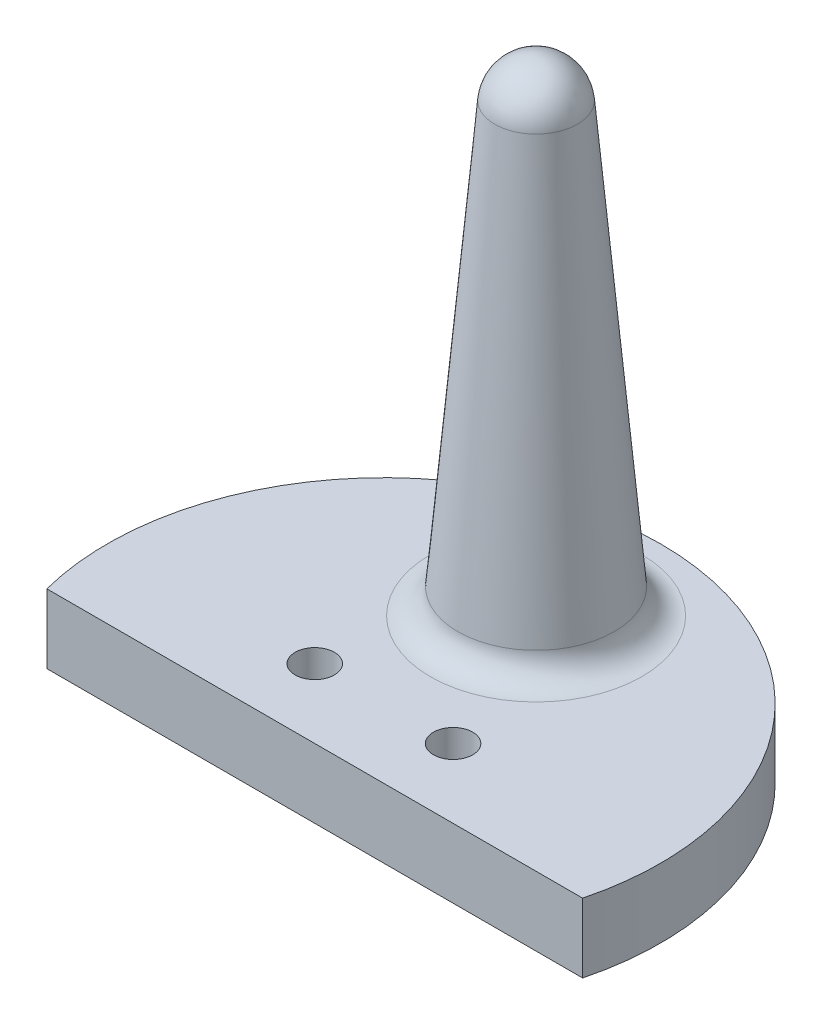
ISO-10303-21;
HEADER;
FILE_DESCRIPTION(('STEP AP214'),'2;1');
FILE_NAME('part.step','',(''),(''),'','','');
FILE_SCHEMA(('AUTOMOTIVE_DESIGN { 1 0 10303 214 1 1 1 1 }'));
ENDSEC;
DATA;
#1=APPLICATION_CONTEXT('core data for automotive mechanical design processes');
#2=APPLICATION_PROTOCOL_DEFINITION('international standard','automotive_design',2000,#1);
#3=PRODUCT_CONTEXT('',#1,'mechanical');
#4=PRODUCT('Part','Part','',(#3));
#5=PRODUCT_RELATED_PRODUCT_CATEGORY('part','',(#4));
#6=PRODUCT_DEFINITION_FORMATION('','',#4);
#7=PRODUCT_DEFINITION_CONTEXT('part definition',#1,'design');
#8=PRODUCT_DEFINITION('design','',#6,#7);
#9=PRODUCT_DEFINITION_SHAPE('','',#8);
#10=(LENGTH_UNIT() NAMED_UNIT(*) SI_UNIT(.MILLI.,.METRE.));
#11=(NAMED_UNIT(*) PLANE_ANGLE_UNIT() SI_UNIT($,.RADIAN.));
#12=(NAMED_UNIT(*) SI_UNIT($,.STERADIAN.) SOLID_ANGLE_UNIT());
#13=UNCERTAINTY_MEASURE_WITH_UNIT(LENGTH_MEASURE(1.E-05),#10,'distance_accuracy_value','');
#14=(GEOMETRIC_REPRESENTATION_CONTEXT(3) GLOBAL_UNCERTAINTY_ASSIGNED_CONTEXT((#13)) GLOBAL_UNIT_ASSIGNED_CONTEXT((#10,
#11,#12)) REPRESENTATION_CONTEXT('',''));
#15=CARTESIAN_POINT('',(0.,0.,0.));
#16=DIRECTION('',(0.,0.,1.));
#17=DIRECTION('',(1.,0.,0.));
#18=AXIS2_PLACEMENT_3D('',#15,#16,#17);
#19=CARTESIAN_POINT('',(0.,5.,0.));
#20=DIRECTION('',(0.,1.,0.));
#21=DIRECTION('',(0.,0.,1.));
#22=AXIS2_PLACEMENT_3D('',#19,#20,#21);
#23=PLANE('',#22);
#24=CARTESIAN_POINT('',(0.,5.,-11.));
#25=DIRECTION('',(0.,1.,0.));
#26=DIRECTION('',(0.,0.,1.));
#27=AXIS2_PLACEMENT_3D('',#24,#25,#26);
#28=CIRCLE('',#27,7.64375909349457);
#29=CARTESIAN_POINT('',(0.,5.,-3.35624090650543));
#30=VERTEX_POINT('',#29);
#31=EDGE_CURVE('E42',#30,#30,#28,.F.);
#32=ORIENTED_EDGE('',*,*,#31,.T.);
#33=EDGE_LOOP('',(#32));
#34=FACE_BOUND('',#33,.T.);
#35=CARTESIAN_POINT('',(-5.,5.,0.));
#36=DIRECTION('',(0.,1.,0.));
#37=DIRECTION('',(0.,0.,1.));
#38=AXIS2_PLACEMENT_3D('',#35,#36,#37);
#39=CIRCLE('',#38,1.42);
#40=CARTESIAN_POINT('',(-5.,5.,1.42));
#41=VERTEX_POINT('',#40);
#42=EDGE_CURVE('E75',#41,#41,#39,.T.);
#43=ORIENTED_EDGE('',*,*,#42,.F.);
#44=EDGE_LOOP('',(#43));
#45=FACE_BOUND('',#44,.T.);
#46=CARTESIAN_POINT('',(0.,5.,0.));
#47=DIRECTION('',(0.,1.,0.));
#48=DIRECTION('',(0.,0.,1.));
#49=AXIS2_PLACEMENT_3D('',#46,#47,#48);
#50=CIRCLE('',#49,20.);
#51=CARTESIAN_POINT('',(19.3649167310371,5.,5.));
#52=VERTEX_POINT('',#51);
#53=CARTESIAN_POINT('',(-19.3649167310371,5.,5.));
#54=VERTEX_POINT('',#53);
#55=EDGE_CURVE('E67',#52,#54,#50,.T.);
#56=ORIENTED_EDGE('',*,*,#55,.T.);
#57=DIRECTION('',(1.,0.,0.));
#58=VECTOR('',#57,1.);
#59=CARTESIAN_POINT('',(-19.3649167310371,5.,5.));
#60=LINE('',#59,#58);
#61=EDGE_CURVE('E49',#54,#52,#60,.T.);
#62=ORIENTED_EDGE('',*,*,#61,.T.);
#63=EDGE_LOOP('',(#56,#62));
#64=FACE_BOUND('',#63,.T.);
#65=CARTESIAN_POINT('',(5.,5.,0.));
#66=DIRECTION('',(0.,1.,0.));
#67=DIRECTION('',(0.,0.,1.));
#68=AXIS2_PLACEMENT_3D('',#65,#66,#67);
#69=CIRCLE('',#68,1.42);
#70=CARTESIAN_POINT('',(5.,5.,1.42));
#71=VERTEX_POINT('',#70);
#72=EDGE_CURVE('E175',#71,#71,#69,.T.);
#73=ORIENTED_EDGE('',*,*,#72,.F.);
#74=EDGE_LOOP('',(#73));
#75=FACE_BOUND('',#74,.T.);
#76=ADVANCED_FACE('F33',(#34,#45,#64,#75),#23,.T.);
#77=CARTESIAN_POINT('',(0.,0.,0.));
#78=DIRECTION('',(0.,1.,0.));
#79=DIRECTION('',(0.,0.,1.));
#80=AXIS2_PLACEMENT_3D('',#77,#78,#79);
#81=PLANE('',#80);
#82=CARTESIAN_POINT('',(0.,0.,0.));
#83=DIRECTION('',(0.,1.,0.));
#84=DIRECTION('',(0.,0.,1.));
#85=AXIS2_PLACEMENT_3D('',#82,#83,#84);
#86=CIRCLE('',#85,20.);
#87=CARTESIAN_POINT('',(19.3649167310371,0.,5.));
#88=VERTEX_POINT('',#87);
#89=CARTESIAN_POINT('',(-19.3649167310371,0.,5.));
#90=VERTEX_POINT('',#89);
#91=EDGE_CURVE('E68',#88,#90,#86,.T.);
#92=ORIENTED_EDGE('',*,*,#91,.F.);
#93=DIRECTION('',(1.,0.,0.));
#94=VECTOR('',#93,1.);
#95=CARTESIAN_POINT('',(-19.3649167310371,0.,5.));
#96=LINE('',#95,#94);
#97=EDGE_CURVE('E57',#90,#88,#96,.T.);
#98=ORIENTED_EDGE('',*,*,#97,.F.);
#99=EDGE_LOOP('',(#92,#98));
#100=FACE_BOUND('',#99,.T.);
#101=CARTESIAN_POINT('',(-5.,0.,0.));
#102=DIRECTION('',(0.,1.,0.));
#103=DIRECTION('',(0.,0.,1.));
#104=AXIS2_PLACEMENT_3D('',#101,#102,#103);
#105=CIRCLE('',#104,1.42);
#106=CARTESIAN_POINT('',(-5.,0.,1.42));
#107=VERTEX_POINT('',#106);
#108=EDGE_CURVE('E78',#107,#107,#105,.T.);
#109=ORIENTED_EDGE('',*,*,#108,.T.);
#110=EDGE_LOOP('',(#109));
#111=FACE_BOUND('',#110,.T.);
#112=CARTESIAN_POINT('',(5.,0.,0.));
#113=DIRECTION('',(0.,1.,0.));
#114=DIRECTION('',(0.,0.,1.));
#115=AXIS2_PLACEMENT_3D('',#112,#113,#114);
#116=CIRCLE('',#115,1.42);
#117=CARTESIAN_POINT('',(5.,0.,1.42));
#118=VERTEX_POINT('',#117);
#119=EDGE_CURVE('E172',#118,#118,#116,.T.);
#120=ORIENTED_EDGE('',*,*,#119,.T.);
#121=EDGE_LOOP('',(#120));
#122=FACE_BOUND('',#121,.T.);
#123=ADVANCED_FACE('F73',(#100,#111,#122),#81,.F.);
#124=CARTESIAN_POINT('',(0.,5.,0.));
#125=DIRECTION('',(0.,-1.,0.));
#126=DIRECTION('',(0.,0.,-1.));
#127=AXIS2_PLACEMENT_3D('',#124,#125,#126);
#128=CYLINDRICAL_SURFACE('',#127,20.);
#129=ORIENTED_EDGE('',*,*,#91,.T.);
#130=DIRECTION('',(0.,-1.,0.));
#131=VECTOR('',#130,1.);
#132=CARTESIAN_POINT('',(-19.3649167310371,5.,5.));
#133=LINE('',#132,#131);
#134=EDGE_CURVE('E65',#54,#90,#133,.T.);
#135=ORIENTED_EDGE('',*,*,#134,.F.);
#136=ORIENTED_EDGE('',*,*,#55,.F.);
#137=DIRECTION('',(0.,-1.,0.));
#138=VECTOR('',#137,1.);
#139=CARTESIAN_POINT('',(19.3649167310371,5.,5.));
#140=LINE('',#139,#138);
#141=EDGE_CURVE('E62',#52,#88,#140,.T.);
#142=ORIENTED_EDGE('',*,*,#141,.T.);
#143=EDGE_LOOP('',(#129,#135,#136,#142));
#144=FACE_BOUND('',#143,.T.);
#145=ADVANCED_FACE('F71',(#144),#128,.T.);
#146=CARTESIAN_POINT('',(-19.3649167310371,5.,5.));
#147=DIRECTION('',(0.,0.,-1.));
#148=DIRECTION('',(-1.,0.,0.));
#149=AXIS2_PLACEMENT_3D('',#146,#147,#148);
#150=PLANE('',#149);
#151=ORIENTED_EDGE('',*,*,#97,.T.);
#152=ORIENTED_EDGE('',*,*,#141,.F.);
#153=ORIENTED_EDGE('',*,*,#61,.F.);
#154=ORIENTED_EDGE('',*,*,#134,.T.);
#155=EDGE_LOOP('',(#151,#152,#153,#154));
#156=FACE_BOUND('',#155,.T.);
#157=ADVANCED_FACE('F61',(#156),#150,.F.);
#158=CARTESIAN_POINT('',(-5.,5.,0.));
#159=DIRECTION('',(0.,-1.,0.));
#160=DIRECTION('',(0.,0.,-1.));
#161=AXIS2_PLACEMENT_3D('',#158,#159,#160);
#162=CYLINDRICAL_SURFACE('',#161,1.42);
#163=ORIENTED_EDGE('',*,*,#42,.T.);
#164=EDGE_LOOP('',(#163));
#165=FACE_BOUND('',#164,.T.);
#166=ORIENTED_EDGE('',*,*,#108,.F.);
#167=EDGE_LOOP('',(#166));
#168=FACE_BOUND('',#167,.T.);
#169=ADVANCED_FACE('F105',(#165,#168),#162,.F.);
#170=CARTESIAN_POINT('',(5.,5.,0.));
#171=DIRECTION('',(0.,-1.,0.));
#172=DIRECTION('',(0.,0.,-1.));
#173=AXIS2_PLACEMENT_3D('',#170,#171,#172);
#174=CYLINDRICAL_SURFACE('',#173,1.42);
#175=ORIENTED_EDGE('',*,*,#72,.T.);
#176=EDGE_LOOP('',(#175));
#177=FACE_BOUND('',#176,.T.);
#178=ORIENTED_EDGE('',*,*,#119,.F.);
#179=EDGE_LOOP('',(#178));
#180=FACE_BOUND('',#179,.T.);
#181=ADVANCED_FACE('F124',(#177,#180),#174,.F.);
#182=CARTESIAN_POINT('',(0.,37.,-11.));
#183=DIRECTION('',(0.,-1.,0.));
#184=DIRECTION('',(-1.,0.,0.));
#185=AXIS2_PLACEMENT_3D('',#182,#183,#184);
#186=SPHERICAL_SURFACE('',#185,3.);
#187=CARTESIAN_POINT('',(0.,37.261467228243,-11.));
#188=DIRECTION('',(0.,-1.,0.));
#189=DIRECTION('',(0.,0.,-1.));
#190=AXIS2_PLACEMENT_3D('',#187,#188,#189);
#191=CIRCLE('',#190,2.98858409427524);
#192=CARTESIAN_POINT('',(0.,37.261467228243,-13.9885840942752));
#193=VERTEX_POINT('',#192);
#194=EDGE_CURVE('E170',#193,#193,#191,.T.);
#195=ORIENTED_EDGE('',*,*,#194,.F.);
#196=EDGE_LOOP('',(#195));
#197=FACE_BOUND('',#196,.T.);
#198=ADVANCED_FACE('F94',(#197),#186,.T.);
#199=CARTESIAN_POINT('',(0.,37.261467228243,-11.));
#200=DIRECTION('',(0.,-1.,0.));
#201=DIRECTION('',(0.,0.,-1.));
#202=AXIS2_PLACEMENT_3D('',#199,#200,#201);
#203=CONICAL_SURFACE('',#202,2.98858409427524,0.0872664625997202);
#204=CARTESIAN_POINT('',(0.,6.82568851450469,-11.));
#205=DIRECTION('',(0.,1.,0.));
#206=DIRECTION('',(0.,0.,1.));
#207=AXIS2_PLACEMENT_3D('',#204,#205,#206);
#208=CIRCLE('',#207,5.65136969731108);
#209=CARTESIAN_POINT('',(0.,6.82568851450469,-5.34863030268892));
#210=VERTEX_POINT('',#209);
#211=EDGE_CURVE('E11',#210,#210,#208,.T.);
#212=ORIENTED_EDGE('',*,*,#211,.T.);
#213=EDGE_LOOP('',(#212));
#214=FACE_BOUND('',#213,.T.);
#215=ORIENTED_EDGE('',*,*,#194,.T.);
#216=EDGE_LOOP('',(#215));
#217=FACE_BOUND('',#216,.T.);
#218=ADVANCED_FACE('F89',(#214,#217),#203,.T.);
#219=CARTESIAN_POINT('',(0.,7.,-11.));
#220=DIRECTION('',(0.,1.,0.));
#221=DIRECTION('',(0.,0.,1.));
#222=AXIS2_PLACEMENT_3D('',#219,#220,#221);
#223=TOROIDAL_SURFACE('',#222,7.64375909349457,2.);
#224=ORIENTED_EDGE('',*,*,#211,.F.);
#225=EDGE_LOOP('',(#224));
#226=FACE_BOUND('',#225,.T.);
#227=ORIENTED_EDGE('',*,*,#31,.F.);
#228=EDGE_LOOP('',(#227));
#229=FACE_BOUND('',#228,.T.);
#230=ADVANCED_FACE('F35',(#226,#229),#223,.F.);
#231=CLOSED_SHELL('',(#76,#123,#145,#157,#169,#181,#198,#218,#230));
#232=MANIFOLD_SOLID_BREP('B2',#231);
#233=ADVANCED_BREP_SHAPE_REPRESENTATION('',(#18,#232),#14);
#234=SHAPE_DEFINITION_REPRESENTATION(#9,#233);
ENDSEC;
END-ISO-10303-21;
